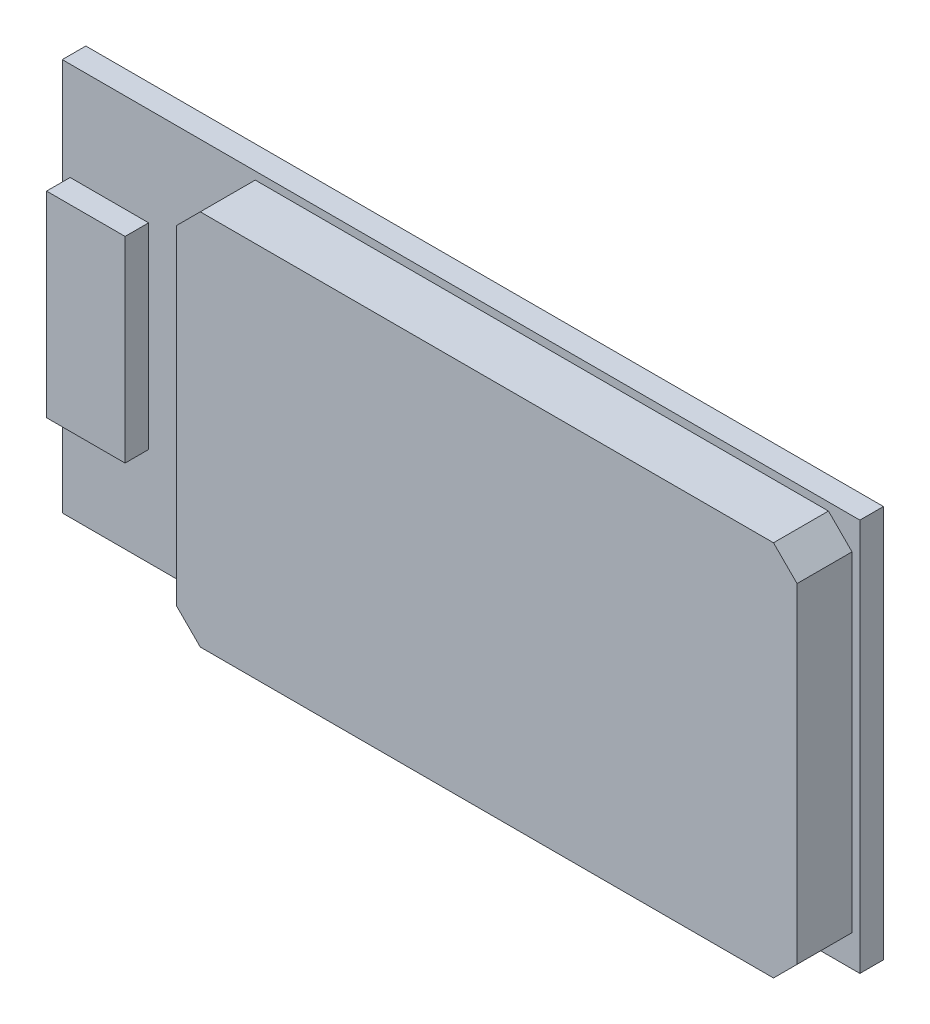
ISO-10303-21;
HEADER;
FILE_DESCRIPTION(('STEP AP214'),'2;1');
FILE_NAME('part.step','',(''),(''),'','','');
FILE_SCHEMA(('AUTOMOTIVE_DESIGN { 1 0 10303 214 1 1 1 1 }'));
ENDSEC;
DATA;
#1=APPLICATION_CONTEXT('core data for automotive mechanical design processes');
#2=APPLICATION_PROTOCOL_DEFINITION('international standard','automotive_design',2000,#1);
#3=PRODUCT_CONTEXT('',#1,'mechanical');
#4=PRODUCT('Part','Part','',(#3));
#5=PRODUCT_RELATED_PRODUCT_CATEGORY('part','',(#4));
#6=PRODUCT_DEFINITION_FORMATION('','',#4);
#7=PRODUCT_DEFINITION_CONTEXT('part definition',#1,'design');
#8=PRODUCT_DEFINITION('design','',#6,#7);
#9=PRODUCT_DEFINITION_SHAPE('','',#8);
#10=(LENGTH_UNIT() NAMED_UNIT(*) SI_UNIT(.MILLI.,.METRE.));
#11=(NAMED_UNIT(*) PLANE_ANGLE_UNIT() SI_UNIT($,.RADIAN.));
#12=(NAMED_UNIT(*) SI_UNIT($,.STERADIAN.) SOLID_ANGLE_UNIT());
#13=UNCERTAINTY_MEASURE_WITH_UNIT(LENGTH_MEASURE(1.E-05),#10,'distance_accuracy_value','');
#14=(GEOMETRIC_REPRESENTATION_CONTEXT(3) GLOBAL_UNCERTAINTY_ASSIGNED_CONTEXT((#13)) GLOBAL_UNIT_ASSIGNED_CONTEXT((#10,
#11,#12)) REPRESENTATION_CONTEXT('',''));
#15=CARTESIAN_POINT('',(0.,0.,0.));
#16=DIRECTION('',(0.,0.,1.));
#17=DIRECTION('',(1.,0.,0.));
#18=AXIS2_PLACEMENT_3D('',#15,#16,#17);
#19=CARTESIAN_POINT('',(0.,0.,0.762));
#20=DIRECTION('',(0.,0.,-1.));
#21=DIRECTION('',(-1.,0.,0.));
#22=AXIS2_PLACEMENT_3D('',#19,#20,#21);
#23=PLANE('',#22);
#24=DIRECTION('',(0.,-1.,0.));
#25=VECTOR('',#24,1.);
#26=CARTESIAN_POINT('',(5.48,12.446,0.762));
#27=LINE('',#26,#25);
#28=CARTESIAN_POINT('',(5.48,11.684,0.762));
#29=VERTEX_POINT('',#28);
#30=CARTESIAN_POINT('',(5.48,1.01600000000001,0.762));
#31=VERTEX_POINT('',#30);
#32=EDGE_CURVE('E166',#29,#31,#27,.T.);
#33=ORIENTED_EDGE('',*,*,#32,.F.);
#34=DIRECTION('',(-0.707106781186551,-0.707106781186544,0.));
#35=VECTOR('',#34,1.);
#36=CARTESIAN_POINT('',(-3.10200000000003,3.10200000000005,0.762));
#37=LINE('',#36,#35);
#38=CARTESIAN_POINT('',(6.242,12.446,0.762));
#39=VERTEX_POINT('',#38);
#40=EDGE_CURVE('E41',#29,#39,#37,.F.);
#41=ORIENTED_EDGE('',*,*,#40,.T.);
#42=DIRECTION('',(-1.,0.,0.));
#43=VECTOR('',#42,1.);
#44=CARTESIAN_POINT('',(5.48,12.446,0.762));
#45=LINE('',#44,#43);
#46=CARTESIAN_POINT('',(24.784,12.446,0.762));
#47=VERTEX_POINT('',#46);
#48=EDGE_CURVE('E179',#47,#39,#45,.T.);
#49=ORIENTED_EDGE('',*,*,#48,.F.);
#50=DIRECTION('',(-0.707106781186546,0.707106781186549,0.));
#51=VECTOR('',#50,1.);
#52=CARTESIAN_POINT('',(18.6150000000001,18.615,0.762));
#53=LINE('',#52,#51);
#54=CARTESIAN_POINT('',(25.546,11.684,0.762));
#55=VERTEX_POINT('',#54);
#56=EDGE_CURVE('E253',#47,#55,#53,.F.);
#57=ORIENTED_EDGE('',*,*,#56,.T.);
#58=DIRECTION('',(0.,1.,0.));
#59=VECTOR('',#58,1.);
#60=CARTESIAN_POINT('',(25.546,12.446,0.762));
#61=LINE('',#60,#59);
#62=CARTESIAN_POINT('',(25.546,1.016,0.762));
#63=VERTEX_POINT('',#62);
#64=EDGE_CURVE('E191',#63,#55,#61,.T.);
#65=ORIENTED_EDGE('',*,*,#64,.F.);
#66=DIRECTION('',(0.707106781186549,0.707106781186546,0.));
#67=VECTOR('',#66,1.);
#68=CARTESIAN_POINT('',(12.2649999999999,-12.265,0.762));
#69=LINE('',#68,#67);
#70=CARTESIAN_POINT('',(24.784,0.253999999999999,0.762));
#71=VERTEX_POINT('',#70);
#72=EDGE_CURVE('E255',#63,#71,#69,.F.);
#73=ORIENTED_EDGE('',*,*,#72,.T.);
#74=DIRECTION('',(1.,0.,0.));
#75=VECTOR('',#74,1.);
#76=CARTESIAN_POINT('',(5.48,0.253999999999999,0.762));
#77=LINE('',#76,#75);
#78=CARTESIAN_POINT('',(6.242,0.253999999999999,0.762));
#79=VERTEX_POINT('',#78);
#80=EDGE_CURVE('E169',#79,#71,#77,.T.);
#81=ORIENTED_EDGE('',*,*,#80,.F.);
#82=DIRECTION('',(0.707106781186546,-0.707106781186549,0.));
#83=VECTOR('',#82,1.);
#84=CARTESIAN_POINT('',(3.24800000000002,3.248,0.762));
#85=LINE('',#84,#83);
#86=EDGE_CURVE('E11',#79,#31,#85,.F.);
#87=ORIENTED_EDGE('',*,*,#86,.T.);
#88=EDGE_LOOP('',(#33,#41,#49,#57,#65,#73,#81,#87));
#89=FACE_BOUND('',#88,.T.);
#90=DIRECTION('',(0.,-1.,0.));
#91=VECTOR('',#90,1.);
#92=CARTESIAN_POINT('',(0.,0.,0.762));
#93=LINE('',#92,#91);
#94=CARTESIAN_POINT('',(0.,12.7,0.762));
#95=VERTEX_POINT('',#94);
#96=CARTESIAN_POINT('',(0.,0.,0.762));
#97=VERTEX_POINT('',#96);
#98=EDGE_CURVE('E196',#95,#97,#93,.T.);
#99=ORIENTED_EDGE('',*,*,#98,.T.);
#100=DIRECTION('',(1.,0.,0.));
#101=VECTOR('',#100,1.);
#102=CARTESIAN_POINT('',(0.,0.,0.762));
#103=LINE('',#102,#101);
#104=CARTESIAN_POINT('',(25.8,0.,0.762));
#105=VERTEX_POINT('',#104);
#106=EDGE_CURVE('E199',#97,#105,#103,.T.);
#107=ORIENTED_EDGE('',*,*,#106,.T.);
#108=DIRECTION('',(0.,1.,0.));
#109=VECTOR('',#108,1.);
#110=CARTESIAN_POINT('',(25.8,0.,0.762));
#111=LINE('',#110,#109);
#112=CARTESIAN_POINT('',(25.8,12.7,0.762));
#113=VERTEX_POINT('',#112);
#114=EDGE_CURVE('E202',#105,#113,#111,.T.);
#115=ORIENTED_EDGE('',*,*,#114,.T.);
#116=DIRECTION('',(-1.,0.,0.));
#117=VECTOR('',#116,1.);
#118=CARTESIAN_POINT('',(0.,12.7,0.762));
#119=LINE('',#118,#117);
#120=EDGE_CURVE('E204',#113,#95,#119,.T.);
#121=ORIENTED_EDGE('',*,*,#120,.T.);
#122=EDGE_LOOP('',(#99,#107,#115,#121));
#123=FACE_BOUND('',#122,.T.);
#124=DIRECTION('',(0.,-1.,0.));
#125=VECTOR('',#124,1.);
#126=CARTESIAN_POINT('',(0.254,9.525,0.762));
#127=LINE('',#126,#125);
#128=CARTESIAN_POINT('',(0.254,9.525,0.762));
#129=VERTEX_POINT('',#128);
#130=CARTESIAN_POINT('',(0.254000000000001,3.175,0.762));
#131=VERTEX_POINT('',#130);
#132=EDGE_CURVE('E165',#129,#131,#127,.T.);
#133=ORIENTED_EDGE('',*,*,#132,.F.);
#134=DIRECTION('',(-1.,0.,0.));
#135=VECTOR('',#134,1.);
#136=CARTESIAN_POINT('',(0.254,9.525,0.762));
#137=LINE('',#136,#135);
#138=CARTESIAN_POINT('',(2.794,9.525,0.762));
#139=VERTEX_POINT('',#138);
#140=EDGE_CURVE('E162',#139,#129,#137,.T.);
#141=ORIENTED_EDGE('',*,*,#140,.F.);
#142=DIRECTION('',(0.,1.,0.));
#143=VECTOR('',#142,1.);
#144=CARTESIAN_POINT('',(2.794,9.525,0.762));
#145=LINE('',#144,#143);
#146=CARTESIAN_POINT('',(2.794,3.175,0.762));
#147=VERTEX_POINT('',#146);
#148=EDGE_CURVE('E53',#147,#139,#145,.T.);
#149=ORIENTED_EDGE('',*,*,#148,.F.);
#150=DIRECTION('',(1.,0.,0.));
#151=VECTOR('',#150,1.);
#152=CARTESIAN_POINT('',(0.254000000000001,3.175,0.762));
#153=LINE('',#152,#151);
#154=EDGE_CURVE('E48',#131,#147,#153,.T.);
#155=ORIENTED_EDGE('',*,*,#154,.F.);
#156=EDGE_LOOP('',(#133,#141,#149,#155));
#157=FACE_BOUND('',#156,.T.);
#158=ADVANCED_FACE('F33',(#89,#123,#157),#23,.F.);
#159=CARTESIAN_POINT('',(0.,0.,0.762));
#160=DIRECTION('',(1.,0.,0.));
#161=DIRECTION('',(0.,0.,-1.));
#162=AXIS2_PLACEMENT_3D('',#159,#160,#161);
#163=PLANE('',#162);
#164=DIRECTION('',(0.,-1.,0.));
#165=VECTOR('',#164,1.);
#166=CARTESIAN_POINT('',(0.,0.,0.));
#167=LINE('',#166,#165);
#168=CARTESIAN_POINT('',(0.,12.7,0.));
#169=VERTEX_POINT('',#168);
#170=CARTESIAN_POINT('',(0.,0.,0.));
#171=VERTEX_POINT('',#170);
#172=EDGE_CURVE('E187',#169,#171,#167,.T.);
#173=ORIENTED_EDGE('',*,*,#172,.T.);
#174=DIRECTION('',(0.,0.,-1.));
#175=VECTOR('',#174,1.);
#176=CARTESIAN_POINT('',(0.,0.,0.762));
#177=LINE('',#176,#175);
#178=EDGE_CURVE('E222',#97,#171,#177,.T.);
#179=ORIENTED_EDGE('',*,*,#178,.F.);
#180=ORIENTED_EDGE('',*,*,#98,.F.);
#181=DIRECTION('',(0.,0.,-1.));
#182=VECTOR('',#181,1.);
#183=CARTESIAN_POINT('',(0.,12.7,0.762));
#184=LINE('',#183,#182);
#185=EDGE_CURVE('E206',#95,#169,#184,.T.);
#186=ORIENTED_EDGE('',*,*,#185,.T.);
#187=EDGE_LOOP('',(#173,#179,#180,#186));
#188=FACE_BOUND('',#187,.T.);
#189=ADVANCED_FACE('F305',(#188),#163,.F.);
#190=CARTESIAN_POINT('',(0.,0.,0.762));
#191=DIRECTION('',(0.,1.,0.));
#192=DIRECTION('',(0.,0.,1.));
#193=AXIS2_PLACEMENT_3D('',#190,#191,#192);
#194=PLANE('',#193);
#195=DIRECTION('',(1.,0.,0.));
#196=VECTOR('',#195,1.);
#197=CARTESIAN_POINT('',(0.,0.,0.));
#198=LINE('',#197,#196);
#199=CARTESIAN_POINT('',(25.8,0.,0.));
#200=VERTEX_POINT('',#199);
#201=EDGE_CURVE('E209',#171,#200,#198,.T.);
#202=ORIENTED_EDGE('',*,*,#201,.T.);
#203=DIRECTION('',(0.,0.,-1.));
#204=VECTOR('',#203,1.);
#205=CARTESIAN_POINT('',(25.8,0.,0.762));
#206=LINE('',#205,#204);
#207=EDGE_CURVE('E219',#105,#200,#206,.T.);
#208=ORIENTED_EDGE('',*,*,#207,.F.);
#209=ORIENTED_EDGE('',*,*,#106,.F.);
#210=ORIENTED_EDGE('',*,*,#178,.T.);
#211=EDGE_LOOP('',(#202,#208,#209,#210));
#212=FACE_BOUND('',#211,.T.);
#213=ADVANCED_FACE('F310',(#212),#194,.F.);
#214=CARTESIAN_POINT('',(25.8,0.,0.762));
#215=DIRECTION('',(-1.,0.,0.));
#216=DIRECTION('',(0.,0.,1.));
#217=AXIS2_PLACEMENT_3D('',#214,#215,#216);
#218=PLANE('',#217);
#219=DIRECTION('',(0.,1.,0.));
#220=VECTOR('',#219,1.);
#221=CARTESIAN_POINT('',(25.8,0.,0.));
#222=LINE('',#221,#220);
#223=CARTESIAN_POINT('',(25.8,12.7,0.));
#224=VERTEX_POINT('',#223);
#225=EDGE_CURVE('E211',#200,#224,#222,.T.);
#226=ORIENTED_EDGE('',*,*,#225,.T.);
#227=DIRECTION('',(0.,0.,-1.));
#228=VECTOR('',#227,1.);
#229=CARTESIAN_POINT('',(25.8,12.7,0.762));
#230=LINE('',#229,#228);
#231=EDGE_CURVE('E216',#113,#224,#230,.T.);
#232=ORIENTED_EDGE('',*,*,#231,.F.);
#233=ORIENTED_EDGE('',*,*,#114,.F.);
#234=ORIENTED_EDGE('',*,*,#207,.T.);
#235=EDGE_LOOP('',(#226,#232,#233,#234));
#236=FACE_BOUND('',#235,.T.);
#237=ADVANCED_FACE('F322',(#236),#218,.F.);
#238=CARTESIAN_POINT('',(0.,12.7,0.762));
#239=DIRECTION('',(0.,-1.,0.));
#240=DIRECTION('',(0.,0.,-1.));
#241=AXIS2_PLACEMENT_3D('',#238,#239,#240);
#242=PLANE('',#241);
#243=DIRECTION('',(-1.,0.,0.));
#244=VECTOR('',#243,1.);
#245=CARTESIAN_POINT('',(0.,12.7,0.));
#246=LINE('',#245,#244);
#247=EDGE_CURVE('E200',#224,#169,#246,.T.);
#248=ORIENTED_EDGE('',*,*,#247,.T.);
#249=ORIENTED_EDGE('',*,*,#185,.F.);
#250=ORIENTED_EDGE('',*,*,#120,.F.);
#251=ORIENTED_EDGE('',*,*,#231,.T.);
#252=EDGE_LOOP('',(#248,#249,#250,#251));
#253=FACE_BOUND('',#252,.T.);
#254=ADVANCED_FACE('F318',(#253),#242,.F.);
#255=CARTESIAN_POINT('',(0.,0.,0.));
#256=DIRECTION('',(0.,0.,-1.));
#257=DIRECTION('',(-1.,0.,0.));
#258=AXIS2_PLACEMENT_3D('',#255,#256,#257);
#259=PLANE('',#258);
#260=ORIENTED_EDGE('',*,*,#172,.F.);
#261=ORIENTED_EDGE('',*,*,#247,.F.);
#262=ORIENTED_EDGE('',*,*,#225,.F.);
#263=ORIENTED_EDGE('',*,*,#201,.F.);
#264=EDGE_LOOP('',(#260,#261,#262,#263));
#265=FACE_BOUND('',#264,.T.);
#266=ADVANCED_FACE('F315',(#265),#259,.T.);
#267=CARTESIAN_POINT('',(5.48,12.446,2.54));
#268=DIRECTION('',(1.,0.,0.));
#269=DIRECTION('',(0.,1.,0.));
#270=AXIS2_PLACEMENT_3D('',#267,#268,#269);
#271=PLANE('',#270);
#272=DIRECTION('',(0.,-1.,0.));
#273=VECTOR('',#272,1.);
#274=CARTESIAN_POINT('',(5.48,12.446,2.54));
#275=LINE('',#274,#273);
#276=CARTESIAN_POINT('',(5.48,11.684,2.54));
#277=VERTEX_POINT('',#276);
#278=CARTESIAN_POINT('',(5.48,1.016,2.54));
#279=VERTEX_POINT('',#278);
#280=EDGE_CURVE('E175',#277,#279,#275,.T.);
#281=ORIENTED_EDGE('',*,*,#280,.F.);
#282=DIRECTION('',(0.,0.,-1.));
#283=VECTOR('',#282,1.);
#284=CARTESIAN_POINT('',(5.48,11.684,2.54));
#285=LINE('',#284,#283);
#286=EDGE_CURVE('E250',#277,#29,#285,.T.);
#287=ORIENTED_EDGE('',*,*,#286,.T.);
#288=ORIENTED_EDGE('',*,*,#32,.T.);
#289=DIRECTION('',(0.,0.,1.));
#290=VECTOR('',#289,1.);
#291=CARTESIAN_POINT('',(5.48,1.016,2.54));
#292=LINE('',#291,#290);
#293=EDGE_CURVE('E248',#31,#279,#292,.T.);
#294=ORIENTED_EDGE('',*,*,#293,.T.);
#295=EDGE_LOOP('',(#281,#287,#288,#294));
#296=FACE_BOUND('',#295,.T.);
#297=ADVANCED_FACE('F274',(#296),#271,.F.);
#298=CARTESIAN_POINT('',(5.48,0.253999999999999,2.54));
#299=DIRECTION('',(0.,1.,0.));
#300=DIRECTION('',(0.,0.,1.));
#301=AXIS2_PLACEMENT_3D('',#298,#299,#300);
#302=PLANE('',#301);
#303=ORIENTED_EDGE('',*,*,#80,.T.);
#304=DIRECTION('',(0.,0.,1.));
#305=VECTOR('',#304,1.);
#306=CARTESIAN_POINT('',(24.784,0.253999999999999,2.54));
#307=LINE('',#306,#305);
#308=CARTESIAN_POINT('',(24.784,0.253999999999998,2.54));
#309=VERTEX_POINT('',#308);
#310=EDGE_CURVE('E246',#71,#309,#307,.T.);
#311=ORIENTED_EDGE('',*,*,#310,.T.);
#312=DIRECTION('',(1.,0.,0.));
#313=VECTOR('',#312,1.);
#314=CARTESIAN_POINT('',(5.48,0.253999999999999,2.54));
#315=LINE('',#314,#313);
#316=CARTESIAN_POINT('',(6.242,0.253999999999999,2.54));
#317=VERTEX_POINT('',#316);
#318=EDGE_CURVE('E178',#317,#309,#315,.T.);
#319=ORIENTED_EDGE('',*,*,#318,.F.);
#320=DIRECTION('',(0.,0.,-1.));
#321=VECTOR('',#320,1.);
#322=CARTESIAN_POINT('',(6.242,0.253999999999999,2.54));
#323=LINE('',#322,#321);
#324=EDGE_CURVE('E243',#317,#79,#323,.T.);
#325=ORIENTED_EDGE('',*,*,#324,.T.);
#326=EDGE_LOOP('',(#303,#311,#319,#325));
#327=FACE_BOUND('',#326,.T.);
#328=ADVANCED_FACE('F281',(#327),#302,.F.);
#329=CARTESIAN_POINT('',(25.546,12.446,2.54));
#330=DIRECTION('',(-1.,0.,0.));
#331=DIRECTION('',(0.,0.,1.));
#332=AXIS2_PLACEMENT_3D('',#329,#330,#331);
#333=PLANE('',#332);
#334=ORIENTED_EDGE('',*,*,#64,.T.);
#335=DIRECTION('',(0.,0.,1.));
#336=VECTOR('',#335,1.);
#337=CARTESIAN_POINT('',(25.546,11.684,2.54));
#338=LINE('',#337,#336);
#339=CARTESIAN_POINT('',(25.546,11.684,2.54));
#340=VERTEX_POINT('',#339);
#341=EDGE_CURVE('E233',#55,#340,#338,.T.);
#342=ORIENTED_EDGE('',*,*,#341,.T.);
#343=DIRECTION('',(0.,1.,0.));
#344=VECTOR('',#343,1.);
#345=CARTESIAN_POINT('',(25.546,12.446,2.54));
#346=LINE('',#345,#344);
#347=CARTESIAN_POINT('',(25.546,1.016,2.54));
#348=VERTEX_POINT('',#347);
#349=EDGE_CURVE('E182',#348,#340,#346,.T.);
#350=ORIENTED_EDGE('',*,*,#349,.F.);
#351=DIRECTION('',(0.,0.,-1.));
#352=VECTOR('',#351,1.);
#353=CARTESIAN_POINT('',(25.546,1.01599999999999,2.54));
#354=LINE('',#353,#352);
#355=EDGE_CURVE('E230',#348,#63,#354,.T.);
#356=ORIENTED_EDGE('',*,*,#355,.T.);
#357=EDGE_LOOP('',(#334,#342,#350,#356));
#358=FACE_BOUND('',#357,.T.);
#359=ADVANCED_FACE('F290',(#358),#333,.F.);
#360=CARTESIAN_POINT('',(5.48,12.446,2.54));
#361=DIRECTION('',(0.,-1.,0.));
#362=DIRECTION('',(0.,0.,-1.));
#363=AXIS2_PLACEMENT_3D('',#360,#361,#362);
#364=PLANE('',#363);
#365=DIRECTION('',(-1.,0.,0.));
#366=VECTOR('',#365,1.);
#367=CARTESIAN_POINT('',(5.48,12.446,2.54));
#368=LINE('',#367,#366);
#369=CARTESIAN_POINT('',(24.784,12.446,2.54));
#370=VERTEX_POINT('',#369);
#371=CARTESIAN_POINT('',(6.24200000000001,12.446,2.54));
#372=VERTEX_POINT('',#371);
#373=EDGE_CURVE('E185',#370,#372,#368,.T.);
#374=ORIENTED_EDGE('',*,*,#373,.F.);
#375=DIRECTION('',(0.,0.,-1.));
#376=VECTOR('',#375,1.);
#377=CARTESIAN_POINT('',(24.784,12.446,2.54));
#378=LINE('',#377,#376);
#379=EDGE_CURVE('E227',#370,#47,#378,.T.);
#380=ORIENTED_EDGE('',*,*,#379,.T.);
#381=ORIENTED_EDGE('',*,*,#48,.T.);
#382=DIRECTION('',(0.,0.,1.));
#383=VECTOR('',#382,1.);
#384=CARTESIAN_POINT('',(6.242,12.446,2.54));
#385=LINE('',#384,#383);
#386=EDGE_CURVE('E225',#39,#372,#385,.T.);
#387=ORIENTED_EDGE('',*,*,#386,.T.);
#388=EDGE_LOOP('',(#374,#380,#381,#387));
#389=FACE_BOUND('',#388,.T.);
#390=ADVANCED_FACE('F265',(#389),#364,.F.);
#391=CARTESIAN_POINT('',(0.,0.,2.54));
#392=DIRECTION('',(0.,0.,1.));
#393=DIRECTION('',(1.,0.,0.));
#394=AXIS2_PLACEMENT_3D('',#391,#392,#393);
#395=PLANE('',#394);
#396=ORIENTED_EDGE('',*,*,#349,.T.);
#397=DIRECTION('',(0.707106781186546,-0.707106781186549,0.));
#398=VECTOR('',#397,1.);
#399=CARTESIAN_POINT('',(18.6150000000001,18.615,2.54));
#400=LINE('',#399,#398);
#401=EDGE_CURVE('E241',#340,#370,#400,.F.);
#402=ORIENTED_EDGE('',*,*,#401,.T.);
#403=ORIENTED_EDGE('',*,*,#373,.T.);
#404=DIRECTION('',(0.707106781186551,0.707106781186544,0.));
#405=VECTOR('',#404,1.);
#406=CARTESIAN_POINT('',(-3.10200000000003,3.10200000000005,2.54));
#407=LINE('',#406,#405);
#408=EDGE_CURVE('E237',#372,#277,#407,.F.);
#409=ORIENTED_EDGE('',*,*,#408,.T.);
#410=ORIENTED_EDGE('',*,*,#280,.T.);
#411=DIRECTION('',(-0.707106781186546,0.707106781186549,0.));
#412=VECTOR('',#411,1.);
#413=CARTESIAN_POINT('',(3.24800000000002,3.248,2.54));
#414=LINE('',#413,#412);
#415=EDGE_CURVE('E235',#279,#317,#414,.F.);
#416=ORIENTED_EDGE('',*,*,#415,.T.);
#417=ORIENTED_EDGE('',*,*,#318,.T.);
#418=DIRECTION('',(-0.707106781186549,-0.707106781186546,0.));
#419=VECTOR('',#418,1.);
#420=CARTESIAN_POINT('',(12.2649999999999,-12.265,2.54));
#421=LINE('',#420,#419);
#422=EDGE_CURVE('E239',#309,#348,#421,.F.);
#423=ORIENTED_EDGE('',*,*,#422,.T.);
#424=EDGE_LOOP('',(#396,#402,#403,#409,#410,#416,#417,#423));
#425=FACE_BOUND('',#424,.T.);
#426=ADVANCED_FACE('F271',(#425),#395,.T.);
#427=CARTESIAN_POINT('',(24.784,12.446,2.54));
#428=DIRECTION('',(-0.707106781186549,-0.707106781186546,0.));
#429=DIRECTION('',(0.,0.,-1.));
#430=AXIS2_PLACEMENT_3D('',#427,#428,#429);
#431=PLANE('',#430);
#432=ORIENTED_EDGE('',*,*,#401,.F.);
#433=ORIENTED_EDGE('',*,*,#341,.F.);
#434=ORIENTED_EDGE('',*,*,#56,.F.);
#435=ORIENTED_EDGE('',*,*,#379,.F.);
#436=EDGE_LOOP('',(#432,#433,#434,#435));
#437=FACE_BOUND('',#436,.T.);
#438=ADVANCED_FACE('F294',(#437),#431,.F.);
#439=CARTESIAN_POINT('',(25.546,1.01599999999999,2.54));
#440=DIRECTION('',(-0.707106781186546,0.707106781186549,0.));
#441=DIRECTION('',(0.,0.,-1.));
#442=AXIS2_PLACEMENT_3D('',#439,#440,#441);
#443=PLANE('',#442);
#444=ORIENTED_EDGE('',*,*,#422,.F.);
#445=ORIENTED_EDGE('',*,*,#310,.F.);
#446=ORIENTED_EDGE('',*,*,#72,.F.);
#447=ORIENTED_EDGE('',*,*,#355,.F.);
#448=EDGE_LOOP('',(#444,#445,#446,#447));
#449=FACE_BOUND('',#448,.T.);
#450=ADVANCED_FACE('F285',(#449),#443,.F.);
#451=CARTESIAN_POINT('',(5.48,11.684,2.54));
#452=DIRECTION('',(0.707106781186544,-0.707106781186551,0.));
#453=DIRECTION('',(0.,0.,-1.));
#454=AXIS2_PLACEMENT_3D('',#451,#452,#453);
#455=PLANE('',#454);
#456=ORIENTED_EDGE('',*,*,#408,.F.);
#457=ORIENTED_EDGE('',*,*,#386,.F.);
#458=ORIENTED_EDGE('',*,*,#40,.F.);
#459=ORIENTED_EDGE('',*,*,#286,.F.);
#460=EDGE_LOOP('',(#456,#457,#458,#459));
#461=FACE_BOUND('',#460,.T.);
#462=ADVANCED_FACE('F268',(#461),#455,.F.);
#463=CARTESIAN_POINT('',(6.242,0.253999999999999,2.54));
#464=DIRECTION('',(0.707106781186549,0.707106781186546,0.));
#465=DIRECTION('',(0.,0.,-1.));
#466=AXIS2_PLACEMENT_3D('',#463,#464,#465);
#467=PLANE('',#466);
#468=ORIENTED_EDGE('',*,*,#415,.F.);
#469=ORIENTED_EDGE('',*,*,#293,.F.);
#470=ORIENTED_EDGE('',*,*,#86,.F.);
#471=ORIENTED_EDGE('',*,*,#324,.F.);
#472=EDGE_LOOP('',(#468,#469,#470,#471));
#473=FACE_BOUND('',#472,.T.);
#474=ADVANCED_FACE('F35',(#473),#467,.F.);
#475=CARTESIAN_POINT('',(0.254,9.525,1.524));
#476=DIRECTION('',(1.,0.,0.));
#477=DIRECTION('',(0.,1.,0.));
#478=AXIS2_PLACEMENT_3D('',#475,#476,#477);
#479=PLANE('',#478);
#480=ORIENTED_EDGE('',*,*,#132,.T.);
#481=DIRECTION('',(0.,0.,-1.));
#482=VECTOR('',#481,1.);
#483=CARTESIAN_POINT('',(0.254000000000001,3.175,1.524));
#484=LINE('',#483,#482);
#485=CARTESIAN_POINT('',(0.254000000000001,3.175,1.524));
#486=VERTEX_POINT('',#485);
#487=EDGE_CURVE('E146',#486,#131,#484,.T.);
#488=ORIENTED_EDGE('',*,*,#487,.F.);
#489=DIRECTION('',(0.,-1.,0.));
#490=VECTOR('',#489,1.);
#491=CARTESIAN_POINT('',(0.254,9.525,1.524));
#492=LINE('',#491,#490);
#493=CARTESIAN_POINT('',(0.254,9.525,1.524));
#494=VERTEX_POINT('',#493);
#495=EDGE_CURVE('E153',#494,#486,#492,.T.);
#496=ORIENTED_EDGE('',*,*,#495,.F.);
#497=DIRECTION('',(0.,0.,-1.));
#498=VECTOR('',#497,1.);
#499=CARTESIAN_POINT('',(0.254,9.525,1.524));
#500=LINE('',#499,#498);
#501=EDGE_CURVE('E346',#494,#129,#500,.T.);
#502=ORIENTED_EDGE('',*,*,#501,.T.);
#503=EDGE_LOOP('',(#480,#488,#496,#502));
#504=FACE_BOUND('',#503,.T.);
#505=ADVANCED_FACE('F164',(#504),#479,.F.);
#506=CARTESIAN_POINT('',(0.254000000000001,3.175,1.524));
#507=DIRECTION('',(0.,1.,0.));
#508=DIRECTION('',(-1.,0.,0.));
#509=AXIS2_PLACEMENT_3D('',#506,#507,#508);
#510=PLANE('',#509);
#511=ORIENTED_EDGE('',*,*,#154,.T.);
#512=DIRECTION('',(0.,0.,-1.));
#513=VECTOR('',#512,1.);
#514=CARTESIAN_POINT('',(2.794,3.175,1.524));
#515=LINE('',#514,#513);
#516=CARTESIAN_POINT('',(2.794,3.175,1.524));
#517=VERTEX_POINT('',#516);
#518=EDGE_CURVE('E149',#517,#147,#515,.T.);
#519=ORIENTED_EDGE('',*,*,#518,.F.);
#520=DIRECTION('',(1.,0.,0.));
#521=VECTOR('',#520,1.);
#522=CARTESIAN_POINT('',(0.254000000000001,3.175,1.524));
#523=LINE('',#522,#521);
#524=EDGE_CURVE('E142',#486,#517,#523,.T.);
#525=ORIENTED_EDGE('',*,*,#524,.F.);
#526=ORIENTED_EDGE('',*,*,#487,.T.);
#527=EDGE_LOOP('',(#511,#519,#525,#526));
#528=FACE_BOUND('',#527,.T.);
#529=ADVANCED_FACE('F144',(#528),#510,.F.);
#530=CARTESIAN_POINT('',(2.794,9.525,1.524));
#531=DIRECTION('',(-1.,0.,0.));
#532=DIRECTION('',(0.,-1.,0.));
#533=AXIS2_PLACEMENT_3D('',#530,#531,#532);
#534=PLANE('',#533);
#535=ORIENTED_EDGE('',*,*,#148,.T.);
#536=DIRECTION('',(0.,0.,-1.));
#537=VECTOR('',#536,1.);
#538=CARTESIAN_POINT('',(2.794,9.525,1.524));
#539=LINE('',#538,#537);
#540=CARTESIAN_POINT('',(2.794,9.525,1.524));
#541=VERTEX_POINT('',#540);
#542=EDGE_CURVE('E171',#541,#139,#539,.T.);
#543=ORIENTED_EDGE('',*,*,#542,.F.);
#544=DIRECTION('',(0.,1.,0.));
#545=VECTOR('',#544,1.);
#546=CARTESIAN_POINT('',(2.794,9.525,1.524));
#547=LINE('',#546,#545);
#548=EDGE_CURVE('E152',#517,#541,#547,.T.);
#549=ORIENTED_EDGE('',*,*,#548,.F.);
#550=ORIENTED_EDGE('',*,*,#518,.T.);
#551=EDGE_LOOP('',(#535,#543,#549,#550));
#552=FACE_BOUND('',#551,.T.);
#553=ADVANCED_FACE('F355',(#552),#534,.F.);
#554=CARTESIAN_POINT('',(0.254,9.525,1.524));
#555=DIRECTION('',(0.,-1.,0.));
#556=DIRECTION('',(0.,0.,-1.));
#557=AXIS2_PLACEMENT_3D('',#554,#555,#556);
#558=PLANE('',#557);
#559=ORIENTED_EDGE('',*,*,#140,.T.);
#560=ORIENTED_EDGE('',*,*,#501,.F.);
#561=DIRECTION('',(-1.,0.,0.));
#562=VECTOR('',#561,1.);
#563=CARTESIAN_POINT('',(0.254,9.525,1.524));
#564=LINE('',#563,#562);
#565=EDGE_CURVE('E158',#541,#494,#564,.T.);
#566=ORIENTED_EDGE('',*,*,#565,.F.);
#567=ORIENTED_EDGE('',*,*,#542,.T.);
#568=EDGE_LOOP('',(#559,#560,#566,#567));
#569=FACE_BOUND('',#568,.T.);
#570=ADVANCED_FACE('F345',(#569),#558,.F.);
#571=CARTESIAN_POINT('',(0.,0.,1.524));
#572=DIRECTION('',(0.,0.,1.));
#573=DIRECTION('',(1.,0.,0.));
#574=AXIS2_PLACEMENT_3D('',#571,#572,#573);
#575=PLANE('',#574);
#576=ORIENTED_EDGE('',*,*,#495,.T.);
#577=ORIENTED_EDGE('',*,*,#524,.T.);
#578=ORIENTED_EDGE('',*,*,#548,.T.);
#579=ORIENTED_EDGE('',*,*,#565,.T.);
#580=EDGE_LOOP('',(#576,#577,#578,#579));
#581=FACE_BOUND('',#580,.T.);
#582=ADVANCED_FACE('F156',(#581),#575,.T.);
#583=CLOSED_SHELL('',(#158,#189,#213,#237,#254,#266,#297,#328,#359,#390,#426,#438,#450,#462,
#474,#505,#529,#553,#570,#582));
#584=MANIFOLD_SOLID_BREP('B2',#583);
#585=ADVANCED_BREP_SHAPE_REPRESENTATION('',(#18,#584),#14);
#586=SHAPE_DEFINITION_REPRESENTATION(#9,#585);
ENDSEC;
END-ISO-10303-21;
